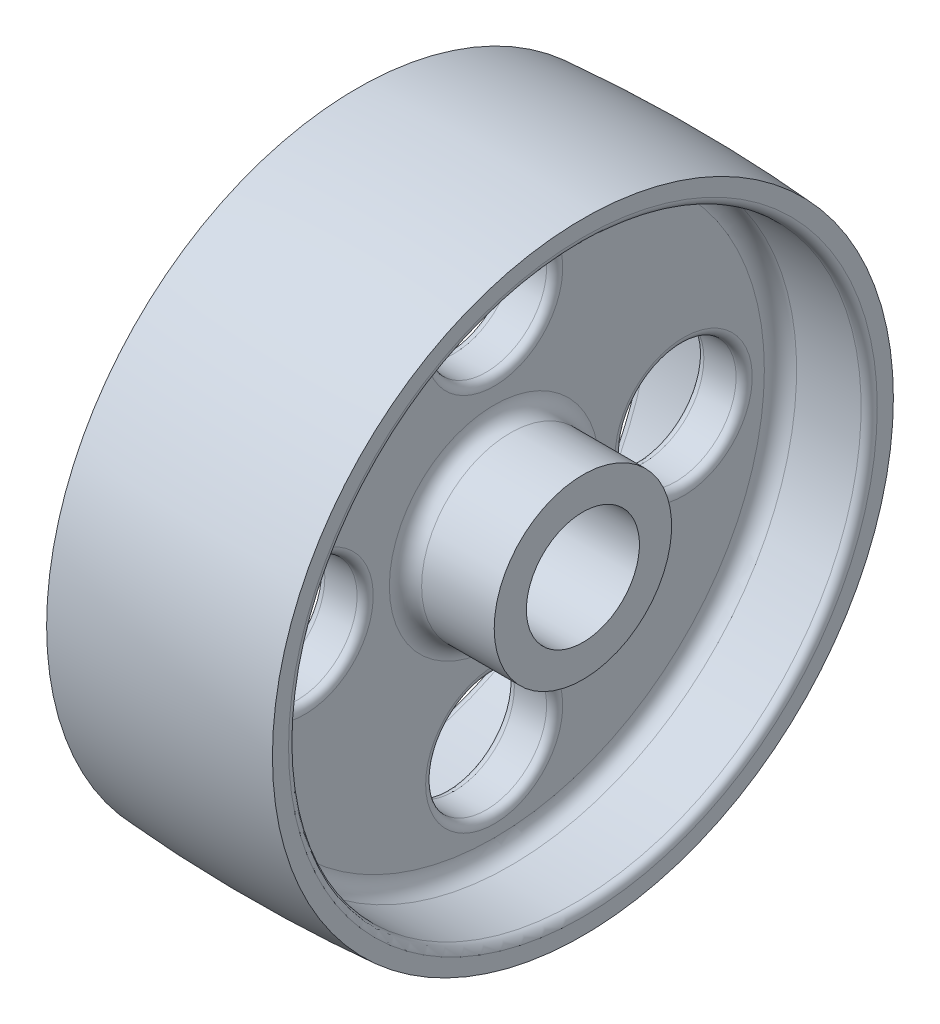
ISO-10303-21;
HEADER;
FILE_DESCRIPTION(('STEP AP214'),'2;1');
FILE_NAME('part.step','',(''),(''),'','','');
FILE_SCHEMA(('AUTOMOTIVE_DESIGN { 1 0 10303 214 1 1 1 1 }'));
ENDSEC;
DATA;
#1=APPLICATION_CONTEXT('core data for automotive mechanical design processes');
#2=APPLICATION_PROTOCOL_DEFINITION('international standard','automotive_design',2000,#1);
#3=PRODUCT_CONTEXT('',#1,'mechanical');
#4=PRODUCT('Part','Part','',(#3));
#5=PRODUCT_RELATED_PRODUCT_CATEGORY('part','',(#4));
#6=PRODUCT_DEFINITION_FORMATION('','',#4);
#7=PRODUCT_DEFINITION_CONTEXT('part definition',#1,'design');
#8=PRODUCT_DEFINITION('design','',#6,#7);
#9=PRODUCT_DEFINITION_SHAPE('','',#8);
#10=(LENGTH_UNIT() NAMED_UNIT(*) SI_UNIT(.MILLI.,.METRE.));
#11=(NAMED_UNIT(*) PLANE_ANGLE_UNIT() SI_UNIT($,.RADIAN.));
#12=(NAMED_UNIT(*) SI_UNIT($,.STERADIAN.) SOLID_ANGLE_UNIT());
#13=UNCERTAINTY_MEASURE_WITH_UNIT(LENGTH_MEASURE(1.E-05),#10,'distance_accuracy_value','');
#14=(GEOMETRIC_REPRESENTATION_CONTEXT(3) GLOBAL_UNCERTAINTY_ASSIGNED_CONTEXT((#13)) GLOBAL_UNIT_ASSIGNED_CONTEXT((#10,
#11,#12)) REPRESENTATION_CONTEXT('',''));
#15=CARTESIAN_POINT('',(0.,0.,0.));
#16=DIRECTION('',(0.,0.,1.));
#17=DIRECTION('',(1.,0.,0.));
#18=AXIS2_PLACEMENT_3D('',#15,#16,#17);
#19=CARTESIAN_POINT('',(0.,0.,0.));
#20=DIRECTION('',(-1.,0.,0.));
#21=DIRECTION('',(0.,0.,1.));
#22=AXIS2_PLACEMENT_3D('',#19,#20,#21);
#23=CYLINDRICAL_SURFACE('',#22,11.1252);
#24=CARTESIAN_POINT('',(22.225,0.,0.));
#25=DIRECTION('',(-1.,0.,0.));
#26=DIRECTION('',(0.,0.,1.));
#27=AXIS2_PLACEMENT_3D('',#24,#25,#26);
#28=CIRCLE('',#27,11.1252);
#29=CARTESIAN_POINT('',(22.225,0.,11.1252));
#30=VERTEX_POINT('',#29);
#31=EDGE_CURVE('E138',#30,#30,#28,.T.);
#32=ORIENTED_EDGE('',*,*,#31,.F.);
#33=EDGE_LOOP('',(#32));
#34=FACE_BOUND('',#33,.T.);
#35=CARTESIAN_POINT('',(-22.225,0.,0.));
#36=DIRECTION('',(-1.,0.,0.));
#37=DIRECTION('',(0.,0.,1.));
#38=AXIS2_PLACEMENT_3D('',#35,#36,#37);
#39=CIRCLE('',#38,11.1252);
#40=CARTESIAN_POINT('',(-22.225,0.,11.1252));
#41=VERTEX_POINT('',#40);
#42=EDGE_CURVE('E87',#41,#41,#39,.T.);
#43=ORIENTED_EDGE('',*,*,#42,.T.);
#44=EDGE_LOOP('',(#43));
#45=FACE_BOUND('',#44,.T.);
#46=ADVANCED_FACE('F31',(#34,#45),#23,.F.);
#47=CARTESIAN_POINT('',(-22.225,11.1252,0.));
#48=DIRECTION('',(1.,0.,0.));
#49=DIRECTION('',(0.,0.,-1.));
#50=AXIS2_PLACEMENT_3D('',#47,#48,#49);
#51=PLANE('',#50);
#52=ORIENTED_EDGE('',*,*,#42,.F.);
#53=EDGE_LOOP('',(#52));
#54=FACE_BOUND('',#53,.T.);
#55=CARTESIAN_POINT('',(-22.225,0.,0.));
#56=DIRECTION('',(-1.,0.,0.));
#57=DIRECTION('',(0.,0.,1.));
#58=AXIS2_PLACEMENT_3D('',#55,#56,#57);
#59=CIRCLE('',#58,17.4625);
#60=CARTESIAN_POINT('',(-22.225,0.,17.4625));
#61=VERTEX_POINT('',#60);
#62=EDGE_CURVE('E90',#61,#61,#59,.T.);
#63=ORIENTED_EDGE('',*,*,#62,.T.);
#64=EDGE_LOOP('',(#63));
#65=FACE_BOUND('',#64,.T.);
#66=ADVANCED_FACE('F146',(#54,#65),#51,.F.);
#67=CARTESIAN_POINT('',(0.,0.,0.));
#68=DIRECTION('',(-1.,0.,0.));
#69=DIRECTION('',(0.,0.,1.));
#70=AXIS2_PLACEMENT_3D('',#67,#68,#69);
#71=CYLINDRICAL_SURFACE('',#70,17.4625);
#72=ORIENTED_EDGE('',*,*,#62,.F.);
#73=EDGE_LOOP('',(#72));
#74=FACE_BOUND('',#73,.T.);
#75=CARTESIAN_POINT('',(-7.9375,0.,0.));
#76=DIRECTION('',(-1.,0.,0.));
#77=DIRECTION('',(0.,0.,1.));
#78=AXIS2_PLACEMENT_3D('',#75,#76,#77);
#79=CIRCLE('',#78,17.4625);
#80=CARTESIAN_POINT('',(-7.9375,0.,17.4625));
#81=VERTEX_POINT('',#80);
#82=EDGE_CURVE('E93',#81,#81,#79,.T.);
#83=ORIENTED_EDGE('',*,*,#82,.T.);
#84=EDGE_LOOP('',(#83));
#85=FACE_BOUND('',#84,.T.);
#86=ADVANCED_FACE('F152',(#74,#85),#71,.T.);
#87=CARTESIAN_POINT('',(-7.9375,0.,0.));
#88=DIRECTION('',(-1.,0.,0.));
#89=DIRECTION('',(0.,0.,1.));
#90=AXIS2_PLACEMENT_3D('',#87,#88,#89);
#91=TOROIDAL_SURFACE('',#90,20.6375,3.175);
#92=ORIENTED_EDGE('',*,*,#82,.F.);
#93=EDGE_LOOP('',(#92));
#94=FACE_BOUND('',#93,.T.);
#95=CARTESIAN_POINT('',(-4.7625,0.,0.));
#96=DIRECTION('',(-1.,0.,0.));
#97=DIRECTION('',(0.,0.,1.));
#98=AXIS2_PLACEMENT_3D('',#95,#96,#97);
#99=CIRCLE('',#98,20.6375);
#100=CARTESIAN_POINT('',(-4.7625,0.,20.6375));
#101=VERTEX_POINT('',#100);
#102=EDGE_CURVE('E96',#101,#101,#99,.T.);
#103=ORIENTED_EDGE('',*,*,#102,.T.);
#104=EDGE_LOOP('',(#103));
#105=FACE_BOUND('',#104,.T.);
#106=ADVANCED_FACE('F158',(#94,#105),#91,.F.);
#107=CARTESIAN_POINT('',(-4.7625,20.6375,0.));
#108=DIRECTION('',(1.,0.,0.));
#109=DIRECTION('',(0.,0.,-1.));
#110=AXIS2_PLACEMENT_3D('',#107,#108,#109);
#111=PLANE('',#110);
#112=CARTESIAN_POINT('',(-4.7625,0.,37.30625));
#113=DIRECTION('',(1.,0.,0.));
#114=DIRECTION('',(0.,0.,-1.));
#115=AXIS2_PLACEMENT_3D('',#112,#113,#114);
#116=CIRCLE('',#115,13.49375);
#117=CARTESIAN_POINT('',(-4.7625,0.,23.8125));
#118=VERTEX_POINT('',#117);
#119=EDGE_CURVE('E10',#118,#118,#116,.T.);
#120=ORIENTED_EDGE('',*,*,#119,.T.);
#121=EDGE_LOOP('',(#120));
#122=FACE_BOUND('',#121,.T.);
#123=CARTESIAN_POINT('',(-4.7625,-37.30625,0.));
#124=DIRECTION('',(1.,0.,0.));
#125=DIRECTION('',(0.,0.,-1.));
#126=AXIS2_PLACEMENT_3D('',#123,#124,#125);
#127=CIRCLE('',#126,13.49375);
#128=CARTESIAN_POINT('',(-4.7625,-37.30625,-13.49375));
#129=VERTEX_POINT('',#128);
#130=EDGE_CURVE('E38',#129,#129,#127,.T.);
#131=ORIENTED_EDGE('',*,*,#130,.T.);
#132=EDGE_LOOP('',(#131));
#133=FACE_BOUND('',#132,.T.);
#134=CARTESIAN_POINT('',(-4.7625,0.,-37.30625));
#135=DIRECTION('',(1.,0.,0.));
#136=DIRECTION('',(0.,0.,-1.));
#137=AXIS2_PLACEMENT_3D('',#134,#135,#136);
#138=CIRCLE('',#137,13.49375);
#139=CARTESIAN_POINT('',(-4.7625,0.,-50.8));
#140=VERTEX_POINT('',#139);
#141=EDGE_CURVE('E42',#140,#140,#138,.T.);
#142=ORIENTED_EDGE('',*,*,#141,.T.);
#143=EDGE_LOOP('',(#142));
#144=FACE_BOUND('',#143,.T.);
#145=CARTESIAN_POINT('',(-4.7625,37.30625,0.));
#146=DIRECTION('',(1.,0.,0.));
#147=DIRECTION('',(0.,0.,-1.));
#148=AXIS2_PLACEMENT_3D('',#145,#146,#147);
#149=CIRCLE('',#148,13.49375);
#150=CARTESIAN_POINT('',(-4.7625,37.30625,-13.49375));
#151=VERTEX_POINT('',#150);
#152=EDGE_CURVE('E46',#151,#151,#149,.T.);
#153=ORIENTED_EDGE('',*,*,#152,.T.);
#154=EDGE_LOOP('',(#153));
#155=FACE_BOUND('',#154,.T.);
#156=ORIENTED_EDGE('',*,*,#102,.F.);
#157=EDGE_LOOP('',(#156));
#158=FACE_BOUND('',#157,.T.);
#159=CARTESIAN_POINT('',(-4.7625,0.,0.));
#160=DIRECTION('',(-1.,0.,0.));
#161=DIRECTION('',(0.,0.,1.));
#162=AXIS2_PLACEMENT_3D('',#159,#160,#161);
#163=CIRCLE('',#162,53.18125);
#164=CARTESIAN_POINT('',(-4.7625,0.,53.18125));
#165=VERTEX_POINT('',#164);
#166=EDGE_CURVE('E99',#165,#165,#163,.T.);
#167=ORIENTED_EDGE('',*,*,#166,.T.);
#168=EDGE_LOOP('',(#167));
#169=FACE_BOUND('',#168,.T.);
#170=ADVANCED_FACE('F164',(#122,#133,#144,#155,#158,#169),#111,.F.);
#171=CARTESIAN_POINT('',(-7.9375,0.,0.));
#172=DIRECTION('',(-1.,0.,0.));
#173=DIRECTION('',(0.,0.,1.));
#174=AXIS2_PLACEMENT_3D('',#171,#172,#173);
#175=TOROIDAL_SURFACE('',#174,53.18125,3.175);
#176=ORIENTED_EDGE('',*,*,#166,.F.);
#177=EDGE_LOOP('',(#176));
#178=FACE_BOUND('',#177,.T.);
#179=CARTESIAN_POINT('',(-7.9375,0.,0.));
#180=DIRECTION('',(-1.,0.,0.));
#181=DIRECTION('',(0.,0.,1.));
#182=AXIS2_PLACEMENT_3D('',#179,#180,#181);
#183=CIRCLE('',#182,56.35625);
#184=CARTESIAN_POINT('',(-7.9375,0.,56.35625));
#185=VERTEX_POINT('',#184);
#186=EDGE_CURVE('E102',#185,#185,#183,.T.);
#187=ORIENTED_EDGE('',*,*,#186,.T.);
#188=EDGE_LOOP('',(#187));
#189=FACE_BOUND('',#188,.T.);
#190=ADVANCED_FACE('F170',(#178,#189),#175,.F.);
#191=CARTESIAN_POINT('',(0.,0.,0.));
#192=DIRECTION('',(-1.,0.,0.));
#193=DIRECTION('',(0.,0.,1.));
#194=AXIS2_PLACEMENT_3D('',#191,#192,#193);
#195=CYLINDRICAL_SURFACE('',#194,56.35625);
#196=ORIENTED_EDGE('',*,*,#186,.F.);
#197=EDGE_LOOP('',(#196));
#198=FACE_BOUND('',#197,.T.);
#199=CARTESIAN_POINT('',(-20.6375,0.,0.));
#200=DIRECTION('',(-1.,0.,0.));
#201=DIRECTION('',(0.,0.,1.));
#202=AXIS2_PLACEMENT_3D('',#199,#200,#201);
#203=CIRCLE('',#202,56.35625);
#204=CARTESIAN_POINT('',(-20.6375,0.,56.35625));
#205=VERTEX_POINT('',#204);
#206=EDGE_CURVE('E105',#205,#205,#203,.T.);
#207=ORIENTED_EDGE('',*,*,#206,.T.);
#208=EDGE_LOOP('',(#207));
#209=FACE_BOUND('',#208,.T.);
#210=ADVANCED_FACE('F176',(#198,#209),#195,.F.);
#211=CARTESIAN_POINT('',(-20.6375,0.,0.));
#212=DIRECTION('',(-1.,0.,0.));
#213=DIRECTION('',(0.,0.,1.));
#214=AXIS2_PLACEMENT_3D('',#211,#212,#213);
#215=TOROIDAL_SURFACE('',#214,57.94375,1.5875);
#216=ORIENTED_EDGE('',*,*,#206,.F.);
#217=EDGE_LOOP('',(#216));
#218=FACE_BOUND('',#217,.T.);
#219=CARTESIAN_POINT('',(-22.225,0.,0.));
#220=DIRECTION('',(-1.,0.,0.));
#221=DIRECTION('',(0.,0.,1.));
#222=AXIS2_PLACEMENT_3D('',#219,#220,#221);
#223=CIRCLE('',#222,57.94375);
#224=CARTESIAN_POINT('',(-22.225,0.,57.94375));
#225=VERTEX_POINT('',#224);
#226=EDGE_CURVE('E108',#225,#225,#223,.T.);
#227=ORIENTED_EDGE('',*,*,#226,.T.);
#228=EDGE_LOOP('',(#227));
#229=FACE_BOUND('',#228,.T.);
#230=ADVANCED_FACE('F182',(#218,#229),#215,.T.);
#231=CARTESIAN_POINT('',(-22.225,57.94375,0.));
#232=DIRECTION('',(1.,0.,0.));
#233=DIRECTION('',(0.,0.,-1.));
#234=AXIS2_PLACEMENT_3D('',#231,#232,#233);
#235=PLANE('',#234);
#236=ORIENTED_EDGE('',*,*,#226,.F.);
#237=EDGE_LOOP('',(#236));
#238=FACE_BOUND('',#237,.T.);
#239=CARTESIAN_POINT('',(-22.225,0.,0.));
#240=DIRECTION('',(-1.,0.,0.));
#241=DIRECTION('',(0.,0.,1.));
#242=AXIS2_PLACEMENT_3D('',#239,#240,#241);
#243=CIRCLE('',#242,61.11875);
#244=CARTESIAN_POINT('',(-22.225,0.,61.11875));
#245=VERTEX_POINT('',#244);
#246=EDGE_CURVE('E111',#245,#245,#243,.T.);
#247=ORIENTED_EDGE('',*,*,#246,.T.);
#248=EDGE_LOOP('',(#247));
#249=FACE_BOUND('',#248,.T.);
#250=ADVANCED_FACE('F188',(#238,#249),#235,.F.);
#251=CARTESIAN_POINT('',(0.,0.,0.));
#252=DIRECTION('',(-1.,0.,0.));
#253=DIRECTION('',(0.,0.,1.));
#254=AXIS2_PLACEMENT_3D('',#251,#252,#253);
#255=DEGENERATE_TOROIDAL_SURFACE('',#254,249.634374999999,311.546874999999,.F.);
#256=ORIENTED_EDGE('',*,*,#246,.F.);
#257=EDGE_LOOP('',(#256));
#258=FACE_BOUND('',#257,.T.);
#259=CARTESIAN_POINT('',(22.225,0.,0.));
#260=DIRECTION('',(-1.,0.,0.));
#261=DIRECTION('',(0.,0.,1.));
#262=AXIS2_PLACEMENT_3D('',#259,#260,#261);
#263=CIRCLE('',#262,61.11875);
#264=CARTESIAN_POINT('',(22.225,0.,61.11875));
#265=VERTEX_POINT('',#264);
#266=EDGE_CURVE('E114',#265,#265,#263,.T.);
#267=ORIENTED_EDGE('',*,*,#266,.T.);
#268=EDGE_LOOP('',(#267));
#269=FACE_BOUND('',#268,.T.);
#270=ADVANCED_FACE('F194',(#258,#269),#255,.F.);
#271=CARTESIAN_POINT('',(22.225,57.94375,0.));
#272=DIRECTION('',(-1.,0.,0.));
#273=DIRECTION('',(0.,0.,1.));
#274=AXIS2_PLACEMENT_3D('',#271,#272,#273);
#275=PLANE('',#274);
#276=ORIENTED_EDGE('',*,*,#266,.F.);
#277=EDGE_LOOP('',(#276));
#278=FACE_BOUND('',#277,.T.);
#279=CARTESIAN_POINT('',(22.225,0.,0.));
#280=DIRECTION('',(-1.,0.,0.));
#281=DIRECTION('',(0.,0.,1.));
#282=AXIS2_PLACEMENT_3D('',#279,#280,#281);
#283=CIRCLE('',#282,57.94375);
#284=CARTESIAN_POINT('',(22.225,0.,57.94375));
#285=VERTEX_POINT('',#284);
#286=EDGE_CURVE('E117',#285,#285,#283,.T.);
#287=ORIENTED_EDGE('',*,*,#286,.T.);
#288=EDGE_LOOP('',(#287));
#289=FACE_BOUND('',#288,.T.);
#290=ADVANCED_FACE('F200',(#278,#289),#275,.F.);
#291=CARTESIAN_POINT('',(20.6375,0.,0.));
#292=DIRECTION('',(-1.,0.,0.));
#293=DIRECTION('',(0.,0.,1.));
#294=AXIS2_PLACEMENT_3D('',#291,#292,#293);
#295=TOROIDAL_SURFACE('',#294,57.94375,1.5875);
#296=ORIENTED_EDGE('',*,*,#286,.F.);
#297=EDGE_LOOP('',(#296));
#298=FACE_BOUND('',#297,.T.);
#299=CARTESIAN_POINT('',(20.6375,0.,0.));
#300=DIRECTION('',(-1.,0.,0.));
#301=DIRECTION('',(0.,0.,1.));
#302=AXIS2_PLACEMENT_3D('',#299,#300,#301);
#303=CIRCLE('',#302,56.35625);
#304=CARTESIAN_POINT('',(20.6375,0.,56.35625));
#305=VERTEX_POINT('',#304);
#306=EDGE_CURVE('E120',#305,#305,#303,.T.);
#307=ORIENTED_EDGE('',*,*,#306,.T.);
#308=EDGE_LOOP('',(#307));
#309=FACE_BOUND('',#308,.T.);
#310=ADVANCED_FACE('F206',(#298,#309),#295,.T.);
#311=CARTESIAN_POINT('',(0.,0.,0.));
#312=DIRECTION('',(-1.,0.,0.));
#313=DIRECTION('',(0.,0.,1.));
#314=AXIS2_PLACEMENT_3D('',#311,#312,#313);
#315=CYLINDRICAL_SURFACE('',#314,56.35625);
#316=ORIENTED_EDGE('',*,*,#306,.F.);
#317=EDGE_LOOP('',(#316));
#318=FACE_BOUND('',#317,.T.);
#319=CARTESIAN_POINT('',(7.9375,0.,0.));
#320=DIRECTION('',(-1.,0.,0.));
#321=DIRECTION('',(0.,0.,1.));
#322=AXIS2_PLACEMENT_3D('',#319,#320,#321);
#323=CIRCLE('',#322,56.35625);
#324=CARTESIAN_POINT('',(7.9375,0.,56.35625));
#325=VERTEX_POINT('',#324);
#326=EDGE_CURVE('E123',#325,#325,#323,.T.);
#327=ORIENTED_EDGE('',*,*,#326,.T.);
#328=EDGE_LOOP('',(#327));
#329=FACE_BOUND('',#328,.T.);
#330=ADVANCED_FACE('F212',(#318,#329),#315,.F.);
#331=CARTESIAN_POINT('',(7.9375,0.,0.));
#332=DIRECTION('',(-1.,0.,0.));
#333=DIRECTION('',(0.,0.,1.));
#334=AXIS2_PLACEMENT_3D('',#331,#332,#333);
#335=TOROIDAL_SURFACE('',#334,53.18125,3.175);
#336=ORIENTED_EDGE('',*,*,#326,.F.);
#337=EDGE_LOOP('',(#336));
#338=FACE_BOUND('',#337,.T.);
#339=CARTESIAN_POINT('',(4.7625,0.,0.));
#340=DIRECTION('',(-1.,0.,0.));
#341=DIRECTION('',(0.,0.,1.));
#342=AXIS2_PLACEMENT_3D('',#339,#340,#341);
#343=CIRCLE('',#342,53.18125);
#344=CARTESIAN_POINT('',(4.7625,0.,53.18125));
#345=VERTEX_POINT('',#344);
#346=EDGE_CURVE('E126',#345,#345,#343,.T.);
#347=ORIENTED_EDGE('',*,*,#346,.T.);
#348=EDGE_LOOP('',(#347));
#349=FACE_BOUND('',#348,.T.);
#350=ADVANCED_FACE('F218',(#338,#349),#335,.F.);
#351=CARTESIAN_POINT('',(4.7625,20.6375,0.));
#352=DIRECTION('',(-1.,0.,0.));
#353=DIRECTION('',(0.,0.,1.));
#354=AXIS2_PLACEMENT_3D('',#351,#352,#353);
#355=PLANE('',#354);
#356=CARTESIAN_POINT('',(4.7625,0.,-37.30625));
#357=DIRECTION('',(-1.,0.,0.));
#358=DIRECTION('',(0.,0.,1.));
#359=AXIS2_PLACEMENT_3D('',#356,#357,#358);
#360=CIRCLE('',#359,13.49375);
#361=CARTESIAN_POINT('',(4.7625,0.,-23.8125));
#362=VERTEX_POINT('',#361);
#363=EDGE_CURVE('E75',#362,#362,#360,.T.);
#364=ORIENTED_EDGE('',*,*,#363,.T.);
#365=EDGE_LOOP('',(#364));
#366=FACE_BOUND('',#365,.T.);
#367=CARTESIAN_POINT('',(4.7625,-37.30625,0.));
#368=DIRECTION('',(-1.,0.,0.));
#369=DIRECTION('',(0.,0.,1.));
#370=AXIS2_PLACEMENT_3D('',#367,#368,#369);
#371=CIRCLE('',#370,13.49375);
#372=CARTESIAN_POINT('',(4.7625,-37.30625,13.49375));
#373=VERTEX_POINT('',#372);
#374=EDGE_CURVE('E78',#373,#373,#371,.T.);
#375=ORIENTED_EDGE('',*,*,#374,.T.);
#376=EDGE_LOOP('',(#375));
#377=FACE_BOUND('',#376,.T.);
#378=CARTESIAN_POINT('',(4.7625,37.30625,0.));
#379=DIRECTION('',(-1.,0.,0.));
#380=DIRECTION('',(0.,0.,1.));
#381=AXIS2_PLACEMENT_3D('',#378,#379,#380);
#382=CIRCLE('',#381,13.49375);
#383=CARTESIAN_POINT('',(4.7625,37.30625,13.49375));
#384=VERTEX_POINT('',#383);
#385=EDGE_CURVE('E81',#384,#384,#382,.T.);
#386=ORIENTED_EDGE('',*,*,#385,.T.);
#387=EDGE_LOOP('',(#386));
#388=FACE_BOUND('',#387,.T.);
#389=CARTESIAN_POINT('',(4.7625,0.,37.30625));
#390=DIRECTION('',(-1.,0.,0.));
#391=DIRECTION('',(0.,0.,1.));
#392=AXIS2_PLACEMENT_3D('',#389,#390,#391);
#393=CIRCLE('',#392,13.49375);
#394=CARTESIAN_POINT('',(4.7625,0.,50.8));
#395=VERTEX_POINT('',#394);
#396=EDGE_CURVE('E84',#395,#395,#393,.T.);
#397=ORIENTED_EDGE('',*,*,#396,.T.);
#398=EDGE_LOOP('',(#397));
#399=FACE_BOUND('',#398,.T.);
#400=ORIENTED_EDGE('',*,*,#346,.F.);
#401=EDGE_LOOP('',(#400));
#402=FACE_BOUND('',#401,.T.);
#403=CARTESIAN_POINT('',(4.7625,0.,0.));
#404=DIRECTION('',(-1.,0.,0.));
#405=DIRECTION('',(0.,0.,1.));
#406=AXIS2_PLACEMENT_3D('',#403,#404,#405);
#407=CIRCLE('',#406,20.6375);
#408=CARTESIAN_POINT('',(4.7625,0.,20.6375));
#409=VERTEX_POINT('',#408);
#410=EDGE_CURVE('E129',#409,#409,#407,.T.);
#411=ORIENTED_EDGE('',*,*,#410,.T.);
#412=EDGE_LOOP('',(#411));
#413=FACE_BOUND('',#412,.T.);
#414=ADVANCED_FACE('F224',(#366,#377,#388,#399,#402,#413),#355,.F.);
#415=CARTESIAN_POINT('',(7.9375,0.,0.));
#416=DIRECTION('',(-1.,0.,0.));
#417=DIRECTION('',(0.,0.,1.));
#418=AXIS2_PLACEMENT_3D('',#415,#416,#417);
#419=TOROIDAL_SURFACE('',#418,20.6375,3.175);
#420=ORIENTED_EDGE('',*,*,#410,.F.);
#421=EDGE_LOOP('',(#420));
#422=FACE_BOUND('',#421,.T.);
#423=CARTESIAN_POINT('',(7.9375,0.,0.));
#424=DIRECTION('',(-1.,0.,0.));
#425=DIRECTION('',(0.,0.,1.));
#426=AXIS2_PLACEMENT_3D('',#423,#424,#425);
#427=CIRCLE('',#426,17.4625);
#428=CARTESIAN_POINT('',(7.9375,0.,17.4625));
#429=VERTEX_POINT('',#428);
#430=EDGE_CURVE('E132',#429,#429,#427,.T.);
#431=ORIENTED_EDGE('',*,*,#430,.T.);
#432=EDGE_LOOP('',(#431));
#433=FACE_BOUND('',#432,.T.);
#434=ADVANCED_FACE('F230',(#422,#433),#419,.F.);
#435=CARTESIAN_POINT('',(0.,0.,0.));
#436=DIRECTION('',(-1.,0.,0.));
#437=DIRECTION('',(0.,0.,1.));
#438=AXIS2_PLACEMENT_3D('',#435,#436,#437);
#439=CYLINDRICAL_SURFACE('',#438,17.4625);
#440=ORIENTED_EDGE('',*,*,#430,.F.);
#441=EDGE_LOOP('',(#440));
#442=FACE_BOUND('',#441,.T.);
#443=CARTESIAN_POINT('',(22.225,0.,0.));
#444=DIRECTION('',(-1.,0.,0.));
#445=DIRECTION('',(0.,0.,1.));
#446=AXIS2_PLACEMENT_3D('',#443,#444,#445);
#447=CIRCLE('',#446,17.4625);
#448=CARTESIAN_POINT('',(22.225,0.,17.4625));
#449=VERTEX_POINT('',#448);
#450=EDGE_CURVE('E135',#449,#449,#447,.T.);
#451=ORIENTED_EDGE('',*,*,#450,.T.);
#452=EDGE_LOOP('',(#451));
#453=FACE_BOUND('',#452,.T.);
#454=ADVANCED_FACE('F237',(#442,#453),#439,.T.);
#455=CARTESIAN_POINT('',(22.225,11.1252,0.));
#456=DIRECTION('',(-1.,0.,0.));
#457=DIRECTION('',(0.,0.,1.));
#458=AXIS2_PLACEMENT_3D('',#455,#456,#457);
#459=PLANE('',#458);
#460=ORIENTED_EDGE('',*,*,#450,.F.);
#461=EDGE_LOOP('',(#460));
#462=FACE_BOUND('',#461,.T.);
#463=ORIENTED_EDGE('',*,*,#31,.T.);
#464=EDGE_LOOP('',(#463));
#465=FACE_BOUND('',#464,.T.);
#466=ADVANCED_FACE('F142',(#462,#465),#459,.F.);
#467=CARTESIAN_POINT('',(22.226,0.,37.30625));
#468=DIRECTION('',(-1.,0.,0.));
#469=DIRECTION('',(0.,0.,1.));
#470=AXIS2_PLACEMENT_3D('',#467,#468,#469);
#471=CYLINDRICAL_SURFACE('',#470,11.90625);
#472=CARTESIAN_POINT('',(3.175,0.,37.30625));
#473=DIRECTION('',(-1.,0.,0.));
#474=DIRECTION('',(0.,0.,1.));
#475=AXIS2_PLACEMENT_3D('',#472,#473,#474);
#476=CIRCLE('',#475,11.90625);
#477=CARTESIAN_POINT('',(3.175,0.,49.2125));
#478=VERTEX_POINT('',#477);
#479=EDGE_CURVE('E51',#478,#478,#476,.F.);
#480=ORIENTED_EDGE('',*,*,#479,.T.);
#481=EDGE_LOOP('',(#480));
#482=FACE_BOUND('',#481,.T.);
#483=CARTESIAN_POINT('',(-3.175,0.,37.30625));
#484=DIRECTION('',(1.,0.,0.));
#485=DIRECTION('',(0.,0.,-1.));
#486=AXIS2_PLACEMENT_3D('',#483,#484,#485);
#487=CIRCLE('',#486,11.90625);
#488=CARTESIAN_POINT('',(-3.175,0.,25.4));
#489=VERTEX_POINT('',#488);
#490=EDGE_CURVE('E54',#489,#489,#487,.F.);
#491=ORIENTED_EDGE('',*,*,#490,.T.);
#492=EDGE_LOOP('',(#491));
#493=FACE_BOUND('',#492,.T.);
#494=ADVANCED_FACE('F247',(#482,#493),#471,.F.);
#495=CARTESIAN_POINT('',(22.226,37.30625,0.));
#496=DIRECTION('',(-1.,0.,0.));
#497=DIRECTION('',(0.,0.,1.));
#498=AXIS2_PLACEMENT_3D('',#495,#496,#497);
#499=CYLINDRICAL_SURFACE('',#498,11.90625);
#500=CARTESIAN_POINT('',(3.175,37.30625,0.));
#501=DIRECTION('',(-1.,0.,0.));
#502=DIRECTION('',(0.,0.,1.));
#503=AXIS2_PLACEMENT_3D('',#500,#501,#502);
#504=CIRCLE('',#503,11.90625);
#505=CARTESIAN_POINT('',(3.175,37.30625,11.90625));
#506=VERTEX_POINT('',#505);
#507=EDGE_CURVE('E57',#506,#506,#504,.F.);
#508=ORIENTED_EDGE('',*,*,#507,.T.);
#509=EDGE_LOOP('',(#508));
#510=FACE_BOUND('',#509,.T.);
#511=CARTESIAN_POINT('',(-3.175,37.30625,0.));
#512=DIRECTION('',(1.,0.,0.));
#513=DIRECTION('',(0.,0.,-1.));
#514=AXIS2_PLACEMENT_3D('',#511,#512,#513);
#515=CIRCLE('',#514,11.90625);
#516=CARTESIAN_POINT('',(-3.175,37.30625,-11.90625));
#517=VERTEX_POINT('',#516);
#518=EDGE_CURVE('E60',#517,#517,#515,.F.);
#519=ORIENTED_EDGE('',*,*,#518,.T.);
#520=EDGE_LOOP('',(#519));
#521=FACE_BOUND('',#520,.T.);
#522=ADVANCED_FACE('F252',(#510,#521),#499,.F.);
#523=CARTESIAN_POINT('',(22.226,0.,-37.30625));
#524=DIRECTION('',(-1.,0.,0.));
#525=DIRECTION('',(0.,0.,1.));
#526=AXIS2_PLACEMENT_3D('',#523,#524,#525);
#527=CYLINDRICAL_SURFACE('',#526,11.90625);
#528=CARTESIAN_POINT('',(3.175,0.,-37.30625));
#529=DIRECTION('',(-1.,0.,0.));
#530=DIRECTION('',(0.,0.,1.));
#531=AXIS2_PLACEMENT_3D('',#528,#529,#530);
#532=CIRCLE('',#531,11.90625);
#533=CARTESIAN_POINT('',(3.175,0.,-25.4));
#534=VERTEX_POINT('',#533);
#535=EDGE_CURVE('E69',#534,#534,#532,.F.);
#536=ORIENTED_EDGE('',*,*,#535,.T.);
#537=EDGE_LOOP('',(#536));
#538=FACE_BOUND('',#537,.T.);
#539=CARTESIAN_POINT('',(-3.175,0.,-37.30625));
#540=DIRECTION('',(1.,0.,0.));
#541=DIRECTION('',(0.,0.,-1.));
#542=AXIS2_PLACEMENT_3D('',#539,#540,#541);
#543=CIRCLE('',#542,11.90625);
#544=CARTESIAN_POINT('',(-3.175,0.,-49.2125));
#545=VERTEX_POINT('',#544);
#546=EDGE_CURVE('E72',#545,#545,#543,.F.);
#547=ORIENTED_EDGE('',*,*,#546,.T.);
#548=EDGE_LOOP('',(#547));
#549=FACE_BOUND('',#548,.T.);
#550=ADVANCED_FACE('F292',(#538,#549),#527,.F.);
#551=CARTESIAN_POINT('',(22.226,-37.30625,0.));
#552=DIRECTION('',(-1.,0.,0.));
#553=DIRECTION('',(0.,0.,1.));
#554=AXIS2_PLACEMENT_3D('',#551,#552,#553);
#555=CYLINDRICAL_SURFACE('',#554,11.90625);
#556=CARTESIAN_POINT('',(3.175,-37.30625,0.));
#557=DIRECTION('',(-1.,0.,0.));
#558=DIRECTION('',(0.,0.,1.));
#559=AXIS2_PLACEMENT_3D('',#556,#557,#558);
#560=CIRCLE('',#559,11.90625);
#561=CARTESIAN_POINT('',(3.175,-37.30625,11.90625));
#562=VERTEX_POINT('',#561);
#563=EDGE_CURVE('E63',#562,#562,#560,.F.);
#564=ORIENTED_EDGE('',*,*,#563,.T.);
#565=EDGE_LOOP('',(#564));
#566=FACE_BOUND('',#565,.T.);
#567=CARTESIAN_POINT('',(-3.175,-37.30625,0.));
#568=DIRECTION('',(1.,0.,0.));
#569=DIRECTION('',(0.,0.,-1.));
#570=AXIS2_PLACEMENT_3D('',#567,#568,#569);
#571=CIRCLE('',#570,11.90625);
#572=CARTESIAN_POINT('',(-3.175,-37.30625,-11.90625));
#573=VERTEX_POINT('',#572);
#574=EDGE_CURVE('E66',#573,#573,#571,.F.);
#575=ORIENTED_EDGE('',*,*,#574,.T.);
#576=EDGE_LOOP('',(#575));
#577=FACE_BOUND('',#576,.T.);
#578=ADVANCED_FACE('F261',(#566,#577),#555,.F.);
#579=CARTESIAN_POINT('',(3.175,0.,-37.30625));
#580=DIRECTION('',(-1.,0.,0.));
#581=DIRECTION('',(0.,0.,1.));
#582=AXIS2_PLACEMENT_3D('',#579,#580,#581);
#583=TOROIDAL_SURFACE('',#582,13.49375,1.5875);
#584=ORIENTED_EDGE('',*,*,#535,.F.);
#585=EDGE_LOOP('',(#584));
#586=FACE_BOUND('',#585,.T.);
#587=ORIENTED_EDGE('',*,*,#363,.F.);
#588=EDGE_LOOP('',(#587));
#589=FACE_BOUND('',#588,.T.);
#590=ADVANCED_FACE('F257',(#586,#589),#583,.T.);
#591=CARTESIAN_POINT('',(3.175,-37.30625,0.));
#592=DIRECTION('',(-1.,0.,0.));
#593=DIRECTION('',(0.,0.,1.));
#594=AXIS2_PLACEMENT_3D('',#591,#592,#593);
#595=TOROIDAL_SURFACE('',#594,13.49375,1.5875);
#596=ORIENTED_EDGE('',*,*,#563,.F.);
#597=EDGE_LOOP('',(#596));
#598=FACE_BOUND('',#597,.T.);
#599=ORIENTED_EDGE('',*,*,#374,.F.);
#600=EDGE_LOOP('',(#599));
#601=FACE_BOUND('',#600,.T.);
#602=ADVANCED_FACE('F260',(#598,#601),#595,.T.);
#603=CARTESIAN_POINT('',(3.175,37.30625,0.));
#604=DIRECTION('',(-1.,0.,0.));
#605=DIRECTION('',(0.,0.,1.));
#606=AXIS2_PLACEMENT_3D('',#603,#604,#605);
#607=TOROIDAL_SURFACE('',#606,13.49375,1.5875);
#608=ORIENTED_EDGE('',*,*,#507,.F.);
#609=EDGE_LOOP('',(#608));
#610=FACE_BOUND('',#609,.T.);
#611=ORIENTED_EDGE('',*,*,#385,.F.);
#612=EDGE_LOOP('',(#611));
#613=FACE_BOUND('',#612,.T.);
#614=ADVANCED_FACE('F265',(#610,#613),#607,.T.);
#615=CARTESIAN_POINT('',(3.175,0.,37.30625));
#616=DIRECTION('',(-1.,0.,0.));
#617=DIRECTION('',(0.,0.,1.));
#618=AXIS2_PLACEMENT_3D('',#615,#616,#617);
#619=TOROIDAL_SURFACE('',#618,13.49375,1.5875);
#620=ORIENTED_EDGE('',*,*,#479,.F.);
#621=EDGE_LOOP('',(#620));
#622=FACE_BOUND('',#621,.T.);
#623=ORIENTED_EDGE('',*,*,#396,.F.);
#624=EDGE_LOOP('',(#623));
#625=FACE_BOUND('',#624,.T.);
#626=ADVANCED_FACE('F269',(#622,#625),#619,.T.);
#627=CARTESIAN_POINT('',(-3.175,0.,37.30625));
#628=DIRECTION('',(1.,0.,0.));
#629=DIRECTION('',(0.,0.,-1.));
#630=AXIS2_PLACEMENT_3D('',#627,#628,#629);
#631=TOROIDAL_SURFACE('',#630,13.49375,1.5875);
#632=ORIENTED_EDGE('',*,*,#119,.F.);
#633=EDGE_LOOP('',(#632));
#634=FACE_BOUND('',#633,.T.);
#635=ORIENTED_EDGE('',*,*,#490,.F.);
#636=EDGE_LOOP('',(#635));
#637=FACE_BOUND('',#636,.T.);
#638=ADVANCED_FACE('F273',(#634,#637),#631,.T.);
#639=CARTESIAN_POINT('',(-3.175,-37.30625,0.));
#640=DIRECTION('',(1.,0.,0.));
#641=DIRECTION('',(0.,0.,-1.));
#642=AXIS2_PLACEMENT_3D('',#639,#640,#641);
#643=TOROIDAL_SURFACE('',#642,13.49375,1.5875);
#644=ORIENTED_EDGE('',*,*,#130,.F.);
#645=EDGE_LOOP('',(#644));
#646=FACE_BOUND('',#645,.T.);
#647=ORIENTED_EDGE('',*,*,#574,.F.);
#648=EDGE_LOOP('',(#647));
#649=FACE_BOUND('',#648,.T.);
#650=ADVANCED_FACE('F277',(#646,#649),#643,.T.);
#651=CARTESIAN_POINT('',(-3.175,0.,-37.30625));
#652=DIRECTION('',(1.,0.,0.));
#653=DIRECTION('',(0.,0.,-1.));
#654=AXIS2_PLACEMENT_3D('',#651,#652,#653);
#655=TOROIDAL_SURFACE('',#654,13.49375,1.5875);
#656=ORIENTED_EDGE('',*,*,#141,.F.);
#657=EDGE_LOOP('',(#656));
#658=FACE_BOUND('',#657,.T.);
#659=ORIENTED_EDGE('',*,*,#546,.F.);
#660=EDGE_LOOP('',(#659));
#661=FACE_BOUND('',#660,.T.);
#662=ADVANCED_FACE('F280',(#658,#661),#655,.T.);
#663=CARTESIAN_POINT('',(-3.175,37.30625,0.));
#664=DIRECTION('',(1.,0.,0.));
#665=DIRECTION('',(0.,0.,-1.));
#666=AXIS2_PLACEMENT_3D('',#663,#664,#665);
#667=TOROIDAL_SURFACE('',#666,13.49375,1.5875);
#668=ORIENTED_EDGE('',*,*,#152,.F.);
#669=EDGE_LOOP('',(#668));
#670=FACE_BOUND('',#669,.T.);
#671=ORIENTED_EDGE('',*,*,#518,.F.);
#672=EDGE_LOOP('',(#671));
#673=FACE_BOUND('',#672,.T.);
#674=ADVANCED_FACE('F33',(#670,#673),#667,.T.);
#675=CLOSED_SHELL('',(#46,#66,#86,#106,#170,#190,#210,#230,#250,#270,#290,#310,#330,#350,#414,
#434,#454,#466,#494,#522,#550,#578,#590,#602,#614,#626,#638,#650,#662,#674));
#676=MANIFOLD_SOLID_BREP('B2',#675);
#677=ADVANCED_BREP_SHAPE_REPRESENTATION('',(#18,#676),#14);
#678=SHAPE_DEFINITION_REPRESENTATION(#9,#677);
ENDSEC;
END-ISO-10303-21;
